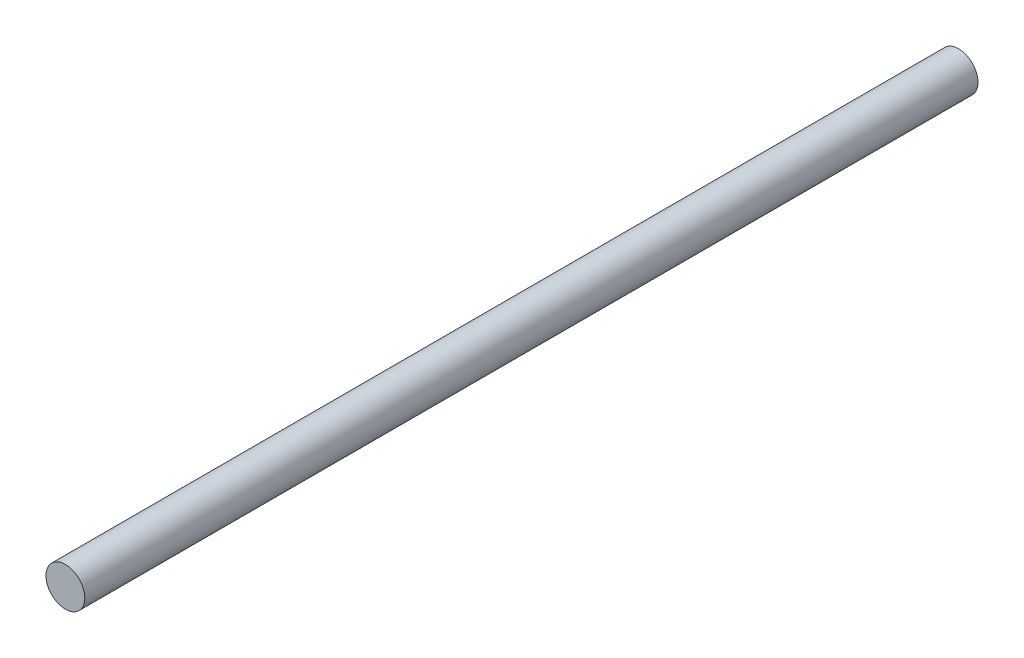
ISO-10303-21;
HEADER;
FILE_DESCRIPTION(('STEP AP214'),'2;1');
FILE_NAME('part.step','',(''),(''),'','','');
FILE_SCHEMA(('AUTOMOTIVE_DESIGN { 1 0 10303 214 1 1 1 1 }'));
ENDSEC;
DATA;
#1=APPLICATION_CONTEXT('core data for automotive mechanical design processes');
#2=APPLICATION_PROTOCOL_DEFINITION('international standard','automotive_design',2000,#1);
#3=PRODUCT_CONTEXT('',#1,'mechanical');
#4=PRODUCT('Part','Part','',(#3));
#5=PRODUCT_RELATED_PRODUCT_CATEGORY('part','',(#4));
#6=PRODUCT_DEFINITION_FORMATION('','',#4);
#7=PRODUCT_DEFINITION_CONTEXT('part definition',#1,'design');
#8=PRODUCT_DEFINITION('design','',#6,#7);
#9=PRODUCT_DEFINITION_SHAPE('','',#8);
#10=(LENGTH_UNIT() NAMED_UNIT(*) SI_UNIT(.MILLI.,.METRE.));
#11=(NAMED_UNIT(*) PLANE_ANGLE_UNIT() SI_UNIT($,.RADIAN.));
#12=(NAMED_UNIT(*) SI_UNIT($,.STERADIAN.) SOLID_ANGLE_UNIT());
#13=UNCERTAINTY_MEASURE_WITH_UNIT(LENGTH_MEASURE(1.E-05),#10,'distance_accuracy_value','');
#14=(GEOMETRIC_REPRESENTATION_CONTEXT(3) GLOBAL_UNCERTAINTY_ASSIGNED_CONTEXT((#13)) GLOBAL_UNIT_ASSIGNED_CONTEXT((#10,
#11,#12)) REPRESENTATION_CONTEXT('',''));
#15=CARTESIAN_POINT('',(0.,0.,0.));
#16=DIRECTION('',(0.,0.,1.));
#17=DIRECTION('',(1.,0.,0.));
#18=AXIS2_PLACEMENT_3D('',#15,#16,#17);
#19=CARTESIAN_POINT('',(0.,0.,23.));
#20=DIRECTION('',(0.,0.,-1.));
#21=DIRECTION('',(-1.,0.,0.));
#22=AXIS2_PLACEMENT_3D('',#19,#20,#21);
#23=CYLINDRICAL_SURFACE('',#22,0.5);
#24=CARTESIAN_POINT('',(0.,0.,23.));
#25=DIRECTION('',(0.,0.,1.));
#26=DIRECTION('',(1.,0.,0.));
#27=AXIS2_PLACEMENT_3D('',#24,#25,#26);
#28=CIRCLE('',#27,0.5);
#29=CARTESIAN_POINT('',(0.5,0.,23.));
#30=VERTEX_POINT('',#29);
#31=EDGE_CURVE('E10',#30,#30,#28,.T.);
#32=ORIENTED_EDGE('',*,*,#31,.F.);
#33=EDGE_LOOP('',(#32));
#34=FACE_BOUND('',#33,.T.);
#35=CARTESIAN_POINT('',(0.,0.,0.));
#36=DIRECTION('',(0.,0.,1.));
#37=DIRECTION('',(1.,0.,0.));
#38=AXIS2_PLACEMENT_3D('',#35,#36,#37);
#39=CIRCLE('',#38,0.5);
#40=CARTESIAN_POINT('',(0.5,0.,0.));
#41=VERTEX_POINT('',#40);
#42=EDGE_CURVE('E33',#41,#41,#39,.T.);
#43=ORIENTED_EDGE('',*,*,#42,.T.);
#44=EDGE_LOOP('',(#43));
#45=FACE_BOUND('',#44,.T.);
#46=ADVANCED_FACE('F30',(#34,#45),#23,.T.);
#47=CARTESIAN_POINT('',(0.,0.,23.));
#48=DIRECTION('',(0.,0.,1.));
#49=DIRECTION('',(1.,0.,0.));
#50=AXIS2_PLACEMENT_3D('',#47,#48,#49);
#51=PLANE('',#50);
#52=ORIENTED_EDGE('',*,*,#31,.T.);
#53=EDGE_LOOP('',(#52));
#54=FACE_BOUND('',#53,.T.);
#55=ADVANCED_FACE('F45',(#54),#51,.T.);
#56=CARTESIAN_POINT('',(0.,0.,0.));
#57=DIRECTION('',(0.,0.,1.));
#58=DIRECTION('',(1.,0.,0.));
#59=AXIS2_PLACEMENT_3D('',#56,#57,#58);
#60=PLANE('',#59);
#61=ORIENTED_EDGE('',*,*,#42,.F.);
#62=EDGE_LOOP('',(#61));
#63=FACE_BOUND('',#62,.T.);
#64=ADVANCED_FACE('F43',(#63),#60,.F.);
#65=CLOSED_SHELL('',(#46,#55,#64));
#66=MANIFOLD_SOLID_BREP('B2',#65);
#67=ADVANCED_BREP_SHAPE_REPRESENTATION('',(#18,#66),#14);
#68=SHAPE_DEFINITION_REPRESENTATION(#9,#67);
ENDSEC;
END-ISO-10303-21;
